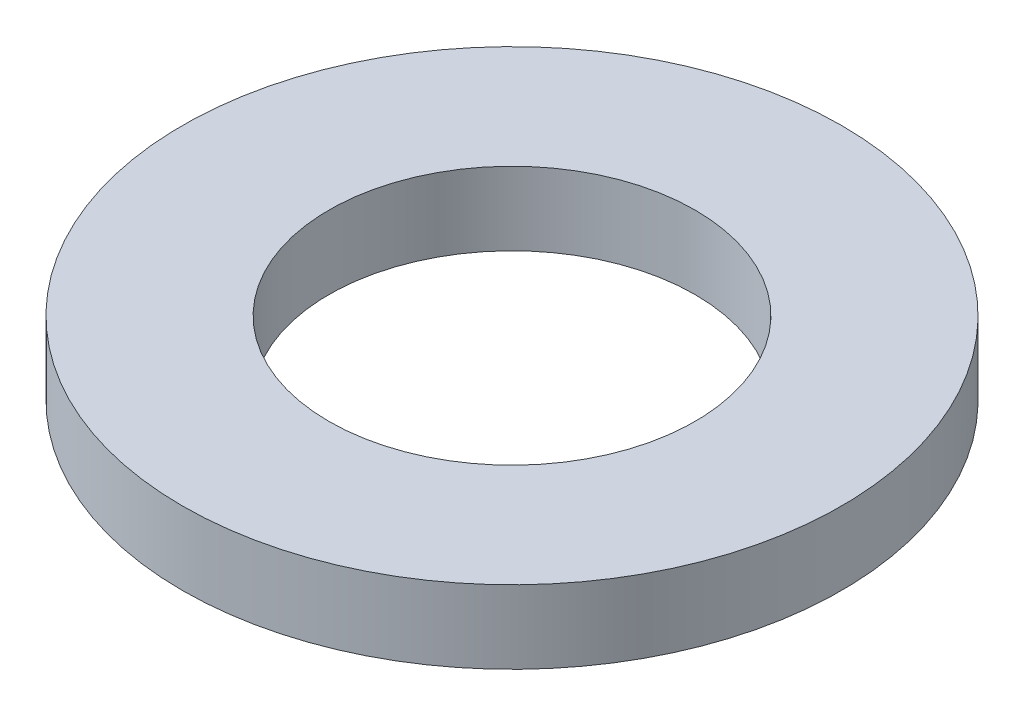
ISO-10303-21;
HEADER;
FILE_DESCRIPTION(('STEP AP214'),'2;1');
FILE_NAME('part.step','',(''),(''),'','','');
FILE_SCHEMA(('AUTOMOTIVE_DESIGN { 1 0 10303 214 1 1 1 1 }'));
ENDSEC;
DATA;
#1=APPLICATION_CONTEXT('core data for automotive mechanical design processes');
#2=APPLICATION_PROTOCOL_DEFINITION('international standard','automotive_design',2000,#1);
#3=PRODUCT_CONTEXT('',#1,'mechanical');
#4=PRODUCT('Part','Part','',(#3));
#5=PRODUCT_RELATED_PRODUCT_CATEGORY('part','',(#4));
#6=PRODUCT_DEFINITION_FORMATION('','',#4);
#7=PRODUCT_DEFINITION_CONTEXT('part definition',#1,'design');
#8=PRODUCT_DEFINITION('design','',#6,#7);
#9=PRODUCT_DEFINITION_SHAPE('','',#8);
#10=(LENGTH_UNIT() NAMED_UNIT(*) SI_UNIT(.MILLI.,.METRE.));
#11=(NAMED_UNIT(*) PLANE_ANGLE_UNIT() SI_UNIT($,.RADIAN.));
#12=(NAMED_UNIT(*) SI_UNIT($,.STERADIAN.) SOLID_ANGLE_UNIT());
#13=UNCERTAINTY_MEASURE_WITH_UNIT(LENGTH_MEASURE(1.E-05),#10,'distance_accuracy_value','');
#14=(GEOMETRIC_REPRESENTATION_CONTEXT(3) GLOBAL_UNCERTAINTY_ASSIGNED_CONTEXT((#13)) GLOBAL_UNIT_ASSIGNED_CONTEXT((#10,
#11,#12)) REPRESENTATION_CONTEXT('',''));
#15=CARTESIAN_POINT('',(0.,0.,0.));
#16=DIRECTION('',(0.,0.,1.));
#17=DIRECTION('',(1.,0.,0.));
#18=AXIS2_PLACEMENT_3D('',#15,#16,#17);
#19=CARTESIAN_POINT('',(0.,2.,0.));
#20=DIRECTION('',(0.,1.,0.));
#21=DIRECTION('',(0.,0.,1.));
#22=AXIS2_PLACEMENT_3D('',#19,#20,#21);
#23=PLANE('',#22);
#24=CARTESIAN_POINT('',(0.,2.,0.));
#25=DIRECTION('',(0.,1.,0.));
#26=DIRECTION('',(0.,0.,1.));
#27=AXIS2_PLACEMENT_3D('',#24,#25,#26);
#28=CIRCLE('',#27,9.);
#29=CARTESIAN_POINT('',(0.,2.,9.));
#30=VERTEX_POINT('',#29);
#31=EDGE_CURVE('E10',#30,#30,#28,.T.);
#32=ORIENTED_EDGE('',*,*,#31,.T.);
#33=EDGE_LOOP('',(#32));
#34=FACE_BOUND('',#33,.T.);
#35=CARTESIAN_POINT('',(0.,2.,0.));
#36=DIRECTION('',(0.,1.,0.));
#37=DIRECTION('',(0.,0.,1.));
#38=AXIS2_PLACEMENT_3D('',#35,#36,#37);
#39=CIRCLE('',#38,5.);
#40=CARTESIAN_POINT('',(0.,2.,5.));
#41=VERTEX_POINT('',#40);
#42=EDGE_CURVE('E25',#41,#41,#39,.T.);
#43=ORIENTED_EDGE('',*,*,#42,.F.);
#44=EDGE_LOOP('',(#43));
#45=FACE_BOUND('',#44,.T.);
#46=ADVANCED_FACE('F14',(#34,#45),#23,.T.);
#47=CARTESIAN_POINT('',(0.,0.,0.));
#48=DIRECTION('',(0.,1.,0.));
#49=DIRECTION('',(0.,0.,1.));
#50=AXIS2_PLACEMENT_3D('',#47,#48,#49);
#51=PLANE('',#50);
#52=CARTESIAN_POINT('',(0.,0.,0.));
#53=DIRECTION('',(0.,1.,0.));
#54=DIRECTION('',(0.,0.,1.));
#55=AXIS2_PLACEMENT_3D('',#52,#53,#54);
#56=CIRCLE('',#55,9.);
#57=CARTESIAN_POINT('',(0.,0.,9.));
#58=VERTEX_POINT('',#57);
#59=EDGE_CURVE('E18',#58,#58,#56,.T.);
#60=ORIENTED_EDGE('',*,*,#59,.F.);
#61=EDGE_LOOP('',(#60));
#62=FACE_BOUND('',#61,.T.);
#63=CARTESIAN_POINT('',(0.,0.,0.));
#64=DIRECTION('',(0.,1.,0.));
#65=DIRECTION('',(0.,0.,1.));
#66=AXIS2_PLACEMENT_3D('',#63,#64,#65);
#67=CIRCLE('',#66,5.);
#68=CARTESIAN_POINT('',(0.,0.,5.));
#69=VERTEX_POINT('',#68);
#70=EDGE_CURVE('E27',#69,#69,#67,.T.);
#71=ORIENTED_EDGE('',*,*,#70,.T.);
#72=EDGE_LOOP('',(#71));
#73=FACE_BOUND('',#72,.T.);
#74=ADVANCED_FACE('F37',(#62,#73),#51,.F.);
#75=CARTESIAN_POINT('',(0.,2.,0.));
#76=DIRECTION('',(0.,-1.,0.));
#77=DIRECTION('',(0.,0.,-1.));
#78=AXIS2_PLACEMENT_3D('',#75,#76,#77);
#79=CYLINDRICAL_SURFACE('',#78,9.);
#80=ORIENTED_EDGE('',*,*,#31,.F.);
#81=EDGE_LOOP('',(#80));
#82=FACE_BOUND('',#81,.T.);
#83=ORIENTED_EDGE('',*,*,#59,.T.);
#84=EDGE_LOOP('',(#83));
#85=FACE_BOUND('',#84,.T.);
#86=ADVANCED_FACE('F16',(#82,#85),#79,.T.);
#87=CARTESIAN_POINT('',(0.,2.,0.));
#88=DIRECTION('',(0.,-1.,0.));
#89=DIRECTION('',(0.,0.,-1.));
#90=AXIS2_PLACEMENT_3D('',#87,#88,#89);
#91=CYLINDRICAL_SURFACE('',#90,5.);
#92=ORIENTED_EDGE('',*,*,#42,.T.);
#93=EDGE_LOOP('',(#92));
#94=FACE_BOUND('',#93,.T.);
#95=ORIENTED_EDGE('',*,*,#70,.F.);
#96=EDGE_LOOP('',(#95));
#97=FACE_BOUND('',#96,.T.);
#98=ADVANCED_FACE('F33',(#94,#97),#91,.F.);
#99=CLOSED_SHELL('',(#46,#74,#86,#98));
#100=MANIFOLD_SOLID_BREP('B1',#99);
#101=ADVANCED_BREP_SHAPE_REPRESENTATION('',(#18,#100),#14);
#102=SHAPE_DEFINITION_REPRESENTATION(#9,#101);
ENDSEC;
END-ISO-10303-21;
